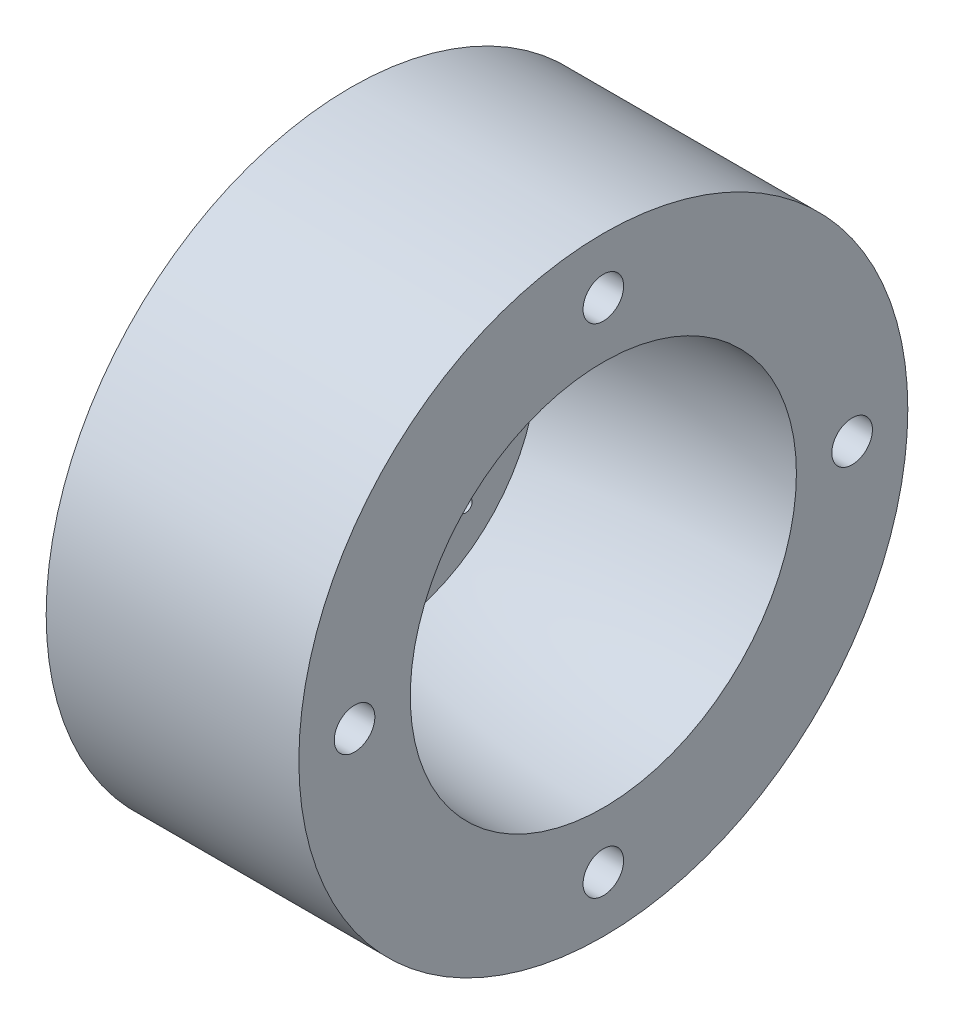
ISO-10303-21;
HEADER;
FILE_DESCRIPTION(('STEP AP214'),'2;1');
FILE_NAME('part.step','',(''),(''),'','','');
FILE_SCHEMA(('AUTOMOTIVE_DESIGN { 1 0 10303 214 1 1 1 1 }'));
ENDSEC;
DATA;
#1=APPLICATION_CONTEXT('core data for automotive mechanical design processes');
#2=APPLICATION_PROTOCOL_DEFINITION('international standard','automotive_design',2000,#1);
#3=PRODUCT_CONTEXT('',#1,'mechanical');
#4=PRODUCT('Part','Part','',(#3));
#5=PRODUCT_RELATED_PRODUCT_CATEGORY('part','',(#4));
#6=PRODUCT_DEFINITION_FORMATION('','',#4);
#7=PRODUCT_DEFINITION_CONTEXT('part definition',#1,'design');
#8=PRODUCT_DEFINITION('design','',#6,#7);
#9=PRODUCT_DEFINITION_SHAPE('','',#8);
#10=(LENGTH_UNIT() NAMED_UNIT(*) SI_UNIT(.MILLI.,.METRE.));
#11=(NAMED_UNIT(*) PLANE_ANGLE_UNIT() SI_UNIT($,.RADIAN.));
#12=(NAMED_UNIT(*) SI_UNIT($,.STERADIAN.) SOLID_ANGLE_UNIT());
#13=UNCERTAINTY_MEASURE_WITH_UNIT(LENGTH_MEASURE(1.E-05),#10,'distance_accuracy_value','');
#14=(GEOMETRIC_REPRESENTATION_CONTEXT(3) GLOBAL_UNCERTAINTY_ASSIGNED_CONTEXT((#13)) GLOBAL_UNIT_ASSIGNED_CONTEXT((#10,
#11,#12)) REPRESENTATION_CONTEXT('',''));
#15=CARTESIAN_POINT('',(0.,0.,0.));
#16=DIRECTION('',(0.,0.,1.));
#17=DIRECTION('',(1.,0.,0.));
#18=AXIS2_PLACEMENT_3D('',#15,#16,#17);
#19=CARTESIAN_POINT('',(0.,0.,0.));
#20=DIRECTION('',(1.,0.,0.));
#21=DIRECTION('',(0.,0.,-1.));
#22=AXIS2_PLACEMENT_3D('',#19,#20,#21);
#23=PLANE('',#22);
#24=CARTESIAN_POINT('',(0.,19.6089948820046,0.));
#25=DIRECTION('',(1.,0.,0.));
#26=DIRECTION('',(0.,0.,-1.));
#27=AXIS2_PLACEMENT_3D('',#24,#25,#26);
#28=CIRCLE('',#27,1.6);
#29=CARTESIAN_POINT('',(0.,19.6089948820046,-1.6));
#30=VERTEX_POINT('',#29);
#31=EDGE_CURVE('E128',#30,#30,#28,.T.);
#32=ORIENTED_EDGE('',*,*,#31,.F.);
#33=EDGE_LOOP('',(#32));
#34=FACE_BOUND('',#33,.T.);
#35=CARTESIAN_POINT('',(0.,0.,19.6089948820046));
#36=DIRECTION('',(1.,0.,0.));
#37=DIRECTION('',(0.,0.,-1.));
#38=AXIS2_PLACEMENT_3D('',#35,#36,#37);
#39=CIRCLE('',#38,1.6);
#40=CARTESIAN_POINT('',(0.,0.,18.0089948820046));
#41=VERTEX_POINT('',#40);
#42=EDGE_CURVE('E132',#41,#41,#39,.T.);
#43=ORIENTED_EDGE('',*,*,#42,.F.);
#44=EDGE_LOOP('',(#43));
#45=FACE_BOUND('',#44,.T.);
#46=CARTESIAN_POINT('',(0.,-19.6089948820046,0.));
#47=DIRECTION('',(1.,0.,0.));
#48=DIRECTION('',(0.,0.,-1.));
#49=AXIS2_PLACEMENT_3D('',#46,#47,#48);
#50=CIRCLE('',#49,1.6);
#51=CARTESIAN_POINT('',(0.,-19.6089948820046,-1.6));
#52=VERTEX_POINT('',#51);
#53=EDGE_CURVE('E85',#52,#52,#50,.T.);
#54=ORIENTED_EDGE('',*,*,#53,.F.);
#55=EDGE_LOOP('',(#54));
#56=FACE_BOUND('',#55,.T.);
#57=CARTESIAN_POINT('',(0.,0.,-19.6089948820046));
#58=DIRECTION('',(1.,0.,0.));
#59=DIRECTION('',(0.,0.,-1.));
#60=AXIS2_PLACEMENT_3D('',#57,#58,#59);
#61=CIRCLE('',#60,1.6);
#62=CARTESIAN_POINT('',(0.,0.,-21.2089948820046));
#63=VERTEX_POINT('',#62);
#64=EDGE_CURVE('E76',#63,#63,#61,.T.);
#65=ORIENTED_EDGE('',*,*,#64,.F.);
#66=EDGE_LOOP('',(#65));
#67=FACE_BOUND('',#66,.T.);
#68=CARTESIAN_POINT('',(0.,0.,0.));
#69=DIRECTION('',(1.,0.,0.));
#70=DIRECTION('',(0.,0.,-1.));
#71=AXIS2_PLACEMENT_3D('',#68,#69,#70);
#72=CIRCLE('',#71,24.);
#73=CARTESIAN_POINT('',(0.,0.,-24.));
#74=VERTEX_POINT('',#73);
#75=EDGE_CURVE('E41',#74,#74,#72,.T.);
#76=ORIENTED_EDGE('',*,*,#75,.T.);
#77=EDGE_LOOP('',(#76));
#78=FACE_BOUND('',#77,.T.);
#79=CARTESIAN_POINT('',(0.,0.,0.));
#80=DIRECTION('',(1.,0.,0.));
#81=DIRECTION('',(0.,0.,-1.));
#82=AXIS2_PLACEMENT_3D('',#79,#80,#81);
#83=CIRCLE('',#82,15.2179897640092);
#84=CARTESIAN_POINT('',(0.,0.,-15.2179897640092));
#85=VERTEX_POINT('',#84);
#86=EDGE_CURVE('E46',#85,#85,#83,.T.);
#87=ORIENTED_EDGE('',*,*,#86,.F.);
#88=EDGE_LOOP('',(#87));
#89=FACE_BOUND('',#88,.T.);
#90=ADVANCED_FACE('F33',(#34,#45,#56,#67,#78,#89),#23,.T.);
#91=CARTESIAN_POINT('',(-19.9164281281048,7.99999999999999,0.));
#92=DIRECTION('',(-1.,0.,0.));
#93=DIRECTION('',(0.,0.,1.));
#94=AXIS2_PLACEMENT_3D('',#91,#92,#93);
#95=PLANE('',#94);
#96=CARTESIAN_POINT('',(-19.9164281281048,10.,0.));
#97=DIRECTION('',(1.,0.,0.));
#98=DIRECTION('',(0.,0.,-1.));
#99=AXIS2_PLACEMENT_3D('',#96,#97,#98);
#100=CIRCLE('',#99,0.5);
#101=CARTESIAN_POINT('',(-19.9164281281048,10.,-0.5));
#102=VERTEX_POINT('',#101);
#103=EDGE_CURVE('E57',#102,#102,#100,.T.);
#104=ORIENTED_EDGE('',*,*,#103,.T.);
#105=EDGE_LOOP('',(#104));
#106=FACE_BOUND('',#105,.T.);
#107=CARTESIAN_POINT('',(-19.9164281281048,7.07106781186549,-7.07106781186546));
#108=DIRECTION('',(1.,0.,0.));
#109=DIRECTION('',(0.,0.,-1.));
#110=AXIS2_PLACEMENT_3D('',#107,#108,#109);
#111=CIRCLE('',#110,0.500000000000001);
#112=CARTESIAN_POINT('',(-19.9164281281048,7.07106781186549,-7.57106781186546));
#113=VERTEX_POINT('',#112);
#114=EDGE_CURVE('E162',#113,#113,#111,.T.);
#115=ORIENTED_EDGE('',*,*,#114,.T.);
#116=EDGE_LOOP('',(#115));
#117=FACE_BOUND('',#116,.T.);
#118=CARTESIAN_POINT('',(-19.9164281281048,-7.07106781186549,7.07106781186546));
#119=DIRECTION('',(1.,0.,0.));
#120=DIRECTION('',(0.,0.,-1.));
#121=AXIS2_PLACEMENT_3D('',#118,#119,#120);
#122=CIRCLE('',#121,0.500000000000001);
#123=CARTESIAN_POINT('',(-19.9164281281048,-7.07106781186549,6.57106781186546));
#124=VERTEX_POINT('',#123);
#125=EDGE_CURVE('E165',#124,#124,#122,.T.);
#126=ORIENTED_EDGE('',*,*,#125,.T.);
#127=EDGE_LOOP('',(#126));
#128=FACE_BOUND('',#127,.T.);
#129=CARTESIAN_POINT('',(-19.9164281281048,-7.07106781186549,-7.07106781186546));
#130=DIRECTION('',(1.,0.,0.));
#131=DIRECTION('',(0.,0.,-1.));
#132=AXIS2_PLACEMENT_3D('',#129,#130,#131);
#133=CIRCLE('',#132,0.5);
#134=CARTESIAN_POINT('',(-19.9164281281048,-7.07106781186549,-7.57106781186546));
#135=VERTEX_POINT('',#134);
#136=EDGE_CURVE('E168',#135,#135,#133,.T.);
#137=ORIENTED_EDGE('',*,*,#136,.T.);
#138=EDGE_LOOP('',(#137));
#139=FACE_BOUND('',#138,.T.);
#140=CARTESIAN_POINT('',(-19.9164281281048,0.,10.));
#141=DIRECTION('',(1.,0.,0.));
#142=DIRECTION('',(0.,0.,-1.));
#143=AXIS2_PLACEMENT_3D('',#140,#141,#142);
#144=CIRCLE('',#143,0.500000000000001);
#145=CARTESIAN_POINT('',(-19.9164281281048,0.,9.5));
#146=VERTEX_POINT('',#145);
#147=EDGE_CURVE('E155',#146,#146,#144,.T.);
#148=ORIENTED_EDGE('',*,*,#147,.T.);
#149=EDGE_LOOP('',(#148));
#150=FACE_BOUND('',#149,.T.);
#151=CARTESIAN_POINT('',(-19.9164281281048,-10.,0.));
#152=DIRECTION('',(1.,0.,0.));
#153=DIRECTION('',(0.,0.,-1.));
#154=AXIS2_PLACEMENT_3D('',#151,#152,#153);
#155=CIRCLE('',#154,0.5);
#156=CARTESIAN_POINT('',(-19.9164281281048,-10.,-0.5));
#157=VERTEX_POINT('',#156);
#158=EDGE_CURVE('E152',#157,#157,#155,.T.);
#159=ORIENTED_EDGE('',*,*,#158,.T.);
#160=EDGE_LOOP('',(#159));
#161=FACE_BOUND('',#160,.T.);
#162=CARTESIAN_POINT('',(-19.9164281281048,0.,-10.));
#163=DIRECTION('',(1.,0.,0.));
#164=DIRECTION('',(0.,0.,-1.));
#165=AXIS2_PLACEMENT_3D('',#162,#163,#164);
#166=CIRCLE('',#165,0.500000000000001);
#167=CARTESIAN_POINT('',(-19.9164281281048,0.,-10.5));
#168=VERTEX_POINT('',#167);
#169=EDGE_CURVE('E156',#168,#168,#166,.T.);
#170=ORIENTED_EDGE('',*,*,#169,.T.);
#171=EDGE_LOOP('',(#170));
#172=FACE_BOUND('',#171,.T.);
#173=CARTESIAN_POINT('',(-19.9164281281048,7.07106781186544,7.07106781186551));
#174=DIRECTION('',(1.,0.,0.));
#175=DIRECTION('',(0.,0.,-1.));
#176=AXIS2_PLACEMENT_3D('',#173,#174,#175);
#177=CIRCLE('',#176,0.5);
#178=CARTESIAN_POINT('',(-19.9164281281048,7.07106781186544,6.57106781186551));
#179=VERTEX_POINT('',#178);
#180=EDGE_CURVE('E159',#179,#179,#177,.T.);
#181=ORIENTED_EDGE('',*,*,#180,.T.);
#182=EDGE_LOOP('',(#181));
#183=FACE_BOUND('',#182,.T.);
#184=CARTESIAN_POINT('',(-19.9164281281048,19.6089948820046,0.));
#185=DIRECTION('',(1.,0.,0.));
#186=DIRECTION('',(0.,0.,-1.));
#187=AXIS2_PLACEMENT_3D('',#184,#185,#186);
#188=CIRCLE('',#187,1.6);
#189=CARTESIAN_POINT('',(-19.9164281281048,19.6089948820046,-1.6));
#190=VERTEX_POINT('',#189);
#191=EDGE_CURVE('E93',#190,#190,#188,.T.);
#192=ORIENTED_EDGE('',*,*,#191,.T.);
#193=EDGE_LOOP('',(#192));
#194=FACE_BOUND('',#193,.T.);
#195=CARTESIAN_POINT('',(-19.9164281281048,0.,19.6089948820046));
#196=DIRECTION('',(1.,0.,0.));
#197=DIRECTION('',(0.,0.,-1.));
#198=AXIS2_PLACEMENT_3D('',#195,#196,#197);
#199=CIRCLE('',#198,1.6);
#200=CARTESIAN_POINT('',(-19.9164281281048,0.,18.0089948820046));
#201=VERTEX_POINT('',#200);
#202=EDGE_CURVE('E146',#201,#201,#199,.T.);
#203=ORIENTED_EDGE('',*,*,#202,.T.);
#204=EDGE_LOOP('',(#203));
#205=FACE_BOUND('',#204,.T.);
#206=CARTESIAN_POINT('',(-19.9164281281048,-19.6089948820046,0.));
#207=DIRECTION('',(1.,0.,0.));
#208=DIRECTION('',(0.,0.,-1.));
#209=AXIS2_PLACEMENT_3D('',#206,#207,#208);
#210=CIRCLE('',#209,1.6);
#211=CARTESIAN_POINT('',(-19.9164281281048,-19.6089948820046,-1.6));
#212=VERTEX_POINT('',#211);
#213=EDGE_CURVE('E141',#212,#212,#210,.T.);
#214=ORIENTED_EDGE('',*,*,#213,.T.);
#215=EDGE_LOOP('',(#214));
#216=FACE_BOUND('',#215,.T.);
#217=CARTESIAN_POINT('',(-19.9164281281048,0.,-19.6089948820046));
#218=DIRECTION('',(1.,0.,0.));
#219=DIRECTION('',(0.,0.,-1.));
#220=AXIS2_PLACEMENT_3D('',#217,#218,#219);
#221=CIRCLE('',#220,1.6);
#222=CARTESIAN_POINT('',(-19.9164281281048,0.,-21.2089948820046));
#223=VERTEX_POINT('',#222);
#224=EDGE_CURVE('E80',#223,#223,#221,.T.);
#225=ORIENTED_EDGE('',*,*,#224,.T.);
#226=EDGE_LOOP('',(#225));
#227=FACE_BOUND('',#226,.T.);
#228=CARTESIAN_POINT('',(-19.9164281281048,0.,0.));
#229=DIRECTION('',(1.,0.,0.));
#230=DIRECTION('',(0.,0.,-1.));
#231=AXIS2_PLACEMENT_3D('',#228,#229,#230);
#232=CIRCLE('',#231,1.25);
#233=CARTESIAN_POINT('',(-19.9164281281048,0.,-1.25));
#234=VERTEX_POINT('',#233);
#235=EDGE_CURVE('E89',#234,#234,#232,.T.);
#236=ORIENTED_EDGE('',*,*,#235,.T.);
#237=EDGE_LOOP('',(#236));
#238=FACE_BOUND('',#237,.T.);
#239=CARTESIAN_POINT('',(-19.9164281281048,0.,0.));
#240=DIRECTION('',(-1.,0.,0.));
#241=DIRECTION('',(0.,0.,1.));
#242=AXIS2_PLACEMENT_3D('',#239,#240,#241);
#243=CIRCLE('',#242,24.);
#244=CARTESIAN_POINT('',(-19.9164281281048,0.,24.));
#245=VERTEX_POINT('',#244);
#246=EDGE_CURVE('E10',#245,#245,#243,.F.);
#247=ORIENTED_EDGE('',*,*,#246,.F.);
#248=EDGE_LOOP('',(#247));
#249=FACE_BOUND('',#248,.T.);
#250=ADVANCED_FACE('F35',(#106,#117,#128,#139,#150,#161,#172,#183,#194,#205,#216,#227,#238,
#249),#95,.T.);
#251=CARTESIAN_POINT('',(-89.7986791220133,0.,0.));
#252=DIRECTION('',(1.,0.,0.));
#253=DIRECTION('',(0.,0.,-1.));
#254=AXIS2_PLACEMENT_3D('',#251,#252,#253);
#255=CYLINDRICAL_SURFACE('',#254,24.);
#256=ORIENTED_EDGE('',*,*,#75,.F.);
#257=EDGE_LOOP('',(#256));
#258=FACE_BOUND('',#257,.T.);
#259=ORIENTED_EDGE('',*,*,#246,.T.);
#260=EDGE_LOOP('',(#259));
#261=FACE_BOUND('',#260,.T.);
#262=ADVANCED_FACE('F108',(#258,#261),#255,.T.);
#263=CARTESIAN_POINT('',(0.,0.,0.));
#264=DIRECTION('',(1.,0.,0.));
#265=DIRECTION('',(0.,0.,-1.));
#266=AXIS2_PLACEMENT_3D('',#263,#264,#265);
#267=DEGENERATE_TOROIDAL_SURFACE('',#266,49.7820102359908,65.,.F.);
#268=ORIENTED_EDGE('',*,*,#86,.T.);
#269=EDGE_LOOP('',(#268));
#270=FACE_BOUND('',#269,.T.);
#271=CARTESIAN_POINT('',(-17.9164281281048,0.,0.));
#272=DIRECTION('',(1.,0.,0.));
#273=DIRECTION('',(0.,0.,-1.));
#274=AXIS2_PLACEMENT_3D('',#271,#272,#273);
#275=CIRCLE('',#274,12.7);
#276=CARTESIAN_POINT('',(-17.9164281281048,0.,-12.7));
#277=VERTEX_POINT('',#276);
#278=EDGE_CURVE('E52',#277,#277,#275,.T.);
#279=ORIENTED_EDGE('',*,*,#278,.F.);
#280=EDGE_LOOP('',(#279));
#281=FACE_BOUND('',#280,.T.);
#282=ADVANCED_FACE('F106',(#270,#281),#267,.T.);
#283=CARTESIAN_POINT('',(-17.9164281281048,7.99999999999999,0.));
#284=DIRECTION('',(-1.,0.,0.));
#285=DIRECTION('',(0.,0.,1.));
#286=AXIS2_PLACEMENT_3D('',#283,#284,#285);
#287=PLANE('',#286);
#288=CARTESIAN_POINT('',(-17.9164281281048,10.,0.));
#289=DIRECTION('',(-1.,0.,0.));
#290=DIRECTION('',(0.,0.,1.));
#291=AXIS2_PLACEMENT_3D('',#288,#289,#290);
#292=CIRCLE('',#291,0.5);
#293=CARTESIAN_POINT('',(-17.9164281281048,10.,0.5));
#294=VERTEX_POINT('',#293);
#295=EDGE_CURVE('E37',#294,#294,#292,.T.);
#296=ORIENTED_EDGE('',*,*,#295,.T.);
#297=EDGE_LOOP('',(#296));
#298=FACE_BOUND('',#297,.T.);
#299=CARTESIAN_POINT('',(-17.9164281281048,7.07106781186549,-7.07106781186546));
#300=DIRECTION('',(-1.,0.,0.));
#301=DIRECTION('',(0.,0.,1.));
#302=AXIS2_PLACEMENT_3D('',#299,#300,#301);
#303=CIRCLE('',#302,0.500000000000001);
#304=CARTESIAN_POINT('',(-17.9164281281048,7.07106781186549,-6.57106781186546));
#305=VERTEX_POINT('',#304);
#306=EDGE_CURVE('E71',#305,#305,#303,.T.);
#307=ORIENTED_EDGE('',*,*,#306,.T.);
#308=EDGE_LOOP('',(#307));
#309=FACE_BOUND('',#308,.T.);
#310=CARTESIAN_POINT('',(-17.9164281281048,-7.07106781186549,7.07106781186546));
#311=DIRECTION('',(-1.,0.,0.));
#312=DIRECTION('',(0.,0.,1.));
#313=AXIS2_PLACEMENT_3D('',#310,#311,#312);
#314=CIRCLE('',#313,0.500000000000001);
#315=CARTESIAN_POINT('',(-17.9164281281048,-7.07106781186549,7.57106781186546));
#316=VERTEX_POINT('',#315);
#317=EDGE_CURVE('E69',#316,#316,#314,.T.);
#318=ORIENTED_EDGE('',*,*,#317,.T.);
#319=EDGE_LOOP('',(#318));
#320=FACE_BOUND('',#319,.T.);
#321=CARTESIAN_POINT('',(-17.9164281281048,-7.07106781186549,-7.07106781186546));
#322=DIRECTION('',(-1.,0.,0.));
#323=DIRECTION('',(0.,0.,1.));
#324=AXIS2_PLACEMENT_3D('',#321,#322,#323);
#325=CIRCLE('',#324,0.5);
#326=CARTESIAN_POINT('',(-17.9164281281048,-7.07106781186549,-6.57106781186547));
#327=VERTEX_POINT('',#326);
#328=EDGE_CURVE('E66',#327,#327,#325,.T.);
#329=ORIENTED_EDGE('',*,*,#328,.T.);
#330=EDGE_LOOP('',(#329));
#331=FACE_BOUND('',#330,.T.);
#332=CARTESIAN_POINT('',(-17.9164281281048,0.,10.));
#333=DIRECTION('',(-1.,0.,0.));
#334=DIRECTION('',(0.,0.,1.));
#335=AXIS2_PLACEMENT_3D('',#332,#333,#334);
#336=CIRCLE('',#335,0.500000000000001);
#337=CARTESIAN_POINT('',(-17.9164281281048,0.,10.5));
#338=VERTEX_POINT('',#337);
#339=EDGE_CURVE('E63',#338,#338,#336,.T.);
#340=ORIENTED_EDGE('',*,*,#339,.T.);
#341=EDGE_LOOP('',(#340));
#342=FACE_BOUND('',#341,.T.);
#343=CARTESIAN_POINT('',(-17.9164281281048,-10.,0.));
#344=DIRECTION('',(-1.,0.,0.));
#345=DIRECTION('',(0.,0.,1.));
#346=AXIS2_PLACEMENT_3D('',#343,#344,#345);
#347=CIRCLE('',#346,0.5);
#348=CARTESIAN_POINT('',(-17.9164281281048,-10.,0.5));
#349=VERTEX_POINT('',#348);
#350=EDGE_CURVE('E60',#349,#349,#347,.T.);
#351=ORIENTED_EDGE('',*,*,#350,.T.);
#352=EDGE_LOOP('',(#351));
#353=FACE_BOUND('',#352,.T.);
#354=CARTESIAN_POINT('',(-17.9164281281048,0.,-10.));
#355=DIRECTION('',(-1.,0.,0.));
#356=DIRECTION('',(0.,0.,1.));
#357=AXIS2_PLACEMENT_3D('',#354,#355,#356);
#358=CIRCLE('',#357,0.500000000000001);
#359=CARTESIAN_POINT('',(-17.9164281281048,0.,-9.5));
#360=VERTEX_POINT('',#359);
#361=EDGE_CURVE('E56',#360,#360,#358,.T.);
#362=ORIENTED_EDGE('',*,*,#361,.T.);
#363=EDGE_LOOP('',(#362));
#364=FACE_BOUND('',#363,.T.);
#365=CARTESIAN_POINT('',(-17.9164281281048,7.07106781186544,7.07106781186551));
#366=DIRECTION('',(-1.,0.,0.));
#367=DIRECTION('',(0.,0.,1.));
#368=AXIS2_PLACEMENT_3D('',#365,#366,#367);
#369=CIRCLE('',#368,0.5);
#370=CARTESIAN_POINT('',(-17.9164281281048,7.07106781186544,7.57106781186551));
#371=VERTEX_POINT('',#370);
#372=EDGE_CURVE('E53',#371,#371,#369,.T.);
#373=ORIENTED_EDGE('',*,*,#372,.T.);
#374=EDGE_LOOP('',(#373));
#375=FACE_BOUND('',#374,.T.);
#376=CARTESIAN_POINT('',(-17.9164281281048,0.,0.));
#377=DIRECTION('',(1.,0.,0.));
#378=DIRECTION('',(0.,0.,-1.));
#379=AXIS2_PLACEMENT_3D('',#376,#377,#378);
#380=CIRCLE('',#379,7.99999999999999);
#381=CARTESIAN_POINT('',(-17.9164281281048,0.,-7.99999999999999));
#382=VERTEX_POINT('',#381);
#383=EDGE_CURVE('E99',#382,#382,#380,.T.);
#384=ORIENTED_EDGE('',*,*,#383,.F.);
#385=EDGE_LOOP('',(#384));
#386=FACE_BOUND('',#385,.T.);
#387=ORIENTED_EDGE('',*,*,#278,.T.);
#388=EDGE_LOOP('',(#387));
#389=FACE_BOUND('',#388,.T.);
#390=ADVANCED_FACE('F104',(#298,#309,#320,#331,#342,#353,#364,#375,#386,#389),#287,.F.);
#391=CARTESIAN_POINT('',(17.9164281281048,0.,0.));
#392=DIRECTION('',(1.,0.,0.));
#393=DIRECTION('',(0.,0.,-1.));
#394=AXIS2_PLACEMENT_3D('',#391,#392,#393);
#395=CYLINDRICAL_SURFACE('',#394,7.99999999999999);
#396=CARTESIAN_POINT('',(-17.4164281281047,0.,0.));
#397=DIRECTION('',(-1.,0.,0.));
#398=DIRECTION('',(0.,0.,1.));
#399=AXIS2_PLACEMENT_3D('',#396,#397,#398);
#400=CIRCLE('',#399,7.99999999999999);
#401=CARTESIAN_POINT('',(-17.4164281281047,0.,7.99999999999999));
#402=VERTEX_POINT('',#401);
#403=EDGE_CURVE('E96',#402,#402,#400,.T.);
#404=ORIENTED_EDGE('',*,*,#403,.T.);
#405=EDGE_LOOP('',(#404));
#406=FACE_BOUND('',#405,.T.);
#407=ORIENTED_EDGE('',*,*,#383,.T.);
#408=EDGE_LOOP('',(#407));
#409=FACE_BOUND('',#408,.T.);
#410=ADVANCED_FACE('F115',(#406,#409),#395,.T.);
#411=CARTESIAN_POINT('',(-17.4164281281047,1.25,0.));
#412=DIRECTION('',(-1.,0.,0.));
#413=DIRECTION('',(0.,0.,1.));
#414=AXIS2_PLACEMENT_3D('',#411,#412,#413);
#415=PLANE('',#414);
#416=CARTESIAN_POINT('',(-17.4164281281047,0.,0.));
#417=DIRECTION('',(-1.,0.,0.));
#418=DIRECTION('',(0.,0.,1.));
#419=AXIS2_PLACEMENT_3D('',#416,#417,#418);
#420=CIRCLE('',#419,1.25);
#421=CARTESIAN_POINT('',(-17.4164281281047,0.,1.25));
#422=VERTEX_POINT('',#421);
#423=EDGE_CURVE('E92',#422,#422,#420,.T.);
#424=ORIENTED_EDGE('',*,*,#423,.T.);
#425=EDGE_LOOP('',(#424));
#426=FACE_BOUND('',#425,.T.);
#427=ORIENTED_EDGE('',*,*,#403,.F.);
#428=EDGE_LOOP('',(#427));
#429=FACE_BOUND('',#428,.T.);
#430=ADVANCED_FACE('F231',(#426,#429),#415,.F.);
#431=CARTESIAN_POINT('',(-19.9164281281048,0.,0.));
#432=DIRECTION('',(1.,0.,0.));
#433=DIRECTION('',(0.,0.,-1.));
#434=AXIS2_PLACEMENT_3D('',#431,#432,#433);
#435=CYLINDRICAL_SURFACE('',#434,1.25);
#436=ORIENTED_EDGE('',*,*,#235,.F.);
#437=EDGE_LOOP('',(#436));
#438=FACE_BOUND('',#437,.T.);
#439=ORIENTED_EDGE('',*,*,#423,.F.);
#440=EDGE_LOOP('',(#439));
#441=FACE_BOUND('',#440,.T.);
#442=ADVANCED_FACE('F227',(#438,#441),#435,.F.);
#443=CARTESIAN_POINT('',(-19.9164281281048,0.,-19.6089948820046));
#444=DIRECTION('',(1.,0.,0.));
#445=DIRECTION('',(0.,0.,-1.));
#446=AXIS2_PLACEMENT_3D('',#443,#444,#445);
#447=CYLINDRICAL_SURFACE('',#446,1.6);
#448=ORIENTED_EDGE('',*,*,#224,.F.);
#449=EDGE_LOOP('',(#448));
#450=FACE_BOUND('',#449,.T.);
#451=ORIENTED_EDGE('',*,*,#64,.T.);
#452=EDGE_LOOP('',(#451));
#453=FACE_BOUND('',#452,.T.);
#454=ADVANCED_FACE('F223',(#450,#453),#447,.F.);
#455=CARTESIAN_POINT('',(-19.9164281281048,-19.6089948820046,0.));
#456=DIRECTION('',(1.,0.,0.));
#457=DIRECTION('',(0.,0.,-1.));
#458=AXIS2_PLACEMENT_3D('',#455,#456,#457);
#459=CYLINDRICAL_SURFACE('',#458,1.6);
#460=ORIENTED_EDGE('',*,*,#213,.F.);
#461=EDGE_LOOP('',(#460));
#462=FACE_BOUND('',#461,.T.);
#463=ORIENTED_EDGE('',*,*,#53,.T.);
#464=EDGE_LOOP('',(#463));
#465=FACE_BOUND('',#464,.T.);
#466=ADVANCED_FACE('F219',(#462,#465),#459,.F.);
#467=CARTESIAN_POINT('',(-19.9164281281048,0.,19.6089948820046));
#468=DIRECTION('',(1.,0.,0.));
#469=DIRECTION('',(0.,0.,-1.));
#470=AXIS2_PLACEMENT_3D('',#467,#468,#469);
#471=CYLINDRICAL_SURFACE('',#470,1.6);
#472=ORIENTED_EDGE('',*,*,#202,.F.);
#473=EDGE_LOOP('',(#472));
#474=FACE_BOUND('',#473,.T.);
#475=ORIENTED_EDGE('',*,*,#42,.T.);
#476=EDGE_LOOP('',(#475));
#477=FACE_BOUND('',#476,.T.);
#478=ADVANCED_FACE('F215',(#474,#477),#471,.F.);
#479=CARTESIAN_POINT('',(-19.9164281281048,19.6089948820046,0.));
#480=DIRECTION('',(1.,0.,0.));
#481=DIRECTION('',(0.,0.,-1.));
#482=AXIS2_PLACEMENT_3D('',#479,#480,#481);
#483=CYLINDRICAL_SURFACE('',#482,1.6);
#484=ORIENTED_EDGE('',*,*,#191,.F.);
#485=EDGE_LOOP('',(#484));
#486=FACE_BOUND('',#485,.T.);
#487=ORIENTED_EDGE('',*,*,#31,.T.);
#488=EDGE_LOOP('',(#487));
#489=FACE_BOUND('',#488,.T.);
#490=ADVANCED_FACE('F205',(#486,#489),#483,.F.);
#491=CARTESIAN_POINT('',(-19.9164281281048,7.07106781186544,7.07106781186551));
#492=DIRECTION('',(1.,0.,0.));
#493=DIRECTION('',(0.,0.,-1.));
#494=AXIS2_PLACEMENT_3D('',#491,#492,#493);
#495=CYLINDRICAL_SURFACE('',#494,0.5);
#496=ORIENTED_EDGE('',*,*,#180,.F.);
#497=EDGE_LOOP('',(#496));
#498=FACE_BOUND('',#497,.T.);
#499=ORIENTED_EDGE('',*,*,#372,.F.);
#500=EDGE_LOOP('',(#499));
#501=FACE_BOUND('',#500,.T.);
#502=ADVANCED_FACE('F201',(#498,#501),#495,.F.);
#503=CARTESIAN_POINT('',(-19.9164281281048,0.,-10.));
#504=DIRECTION('',(1.,0.,0.));
#505=DIRECTION('',(0.,0.,-1.));
#506=AXIS2_PLACEMENT_3D('',#503,#504,#505);
#507=CYLINDRICAL_SURFACE('',#506,0.500000000000001);
#508=ORIENTED_EDGE('',*,*,#169,.F.);
#509=EDGE_LOOP('',(#508));
#510=FACE_BOUND('',#509,.T.);
#511=ORIENTED_EDGE('',*,*,#361,.F.);
#512=EDGE_LOOP('',(#511));
#513=FACE_BOUND('',#512,.T.);
#514=ADVANCED_FACE('F197',(#510,#513),#507,.F.);
#515=CARTESIAN_POINT('',(-19.9164281281048,-10.,0.));
#516=DIRECTION('',(1.,0.,0.));
#517=DIRECTION('',(0.,0.,-1.));
#518=AXIS2_PLACEMENT_3D('',#515,#516,#517);
#519=CYLINDRICAL_SURFACE('',#518,0.5);
#520=ORIENTED_EDGE('',*,*,#158,.F.);
#521=EDGE_LOOP('',(#520));
#522=FACE_BOUND('',#521,.T.);
#523=ORIENTED_EDGE('',*,*,#350,.F.);
#524=EDGE_LOOP('',(#523));
#525=FACE_BOUND('',#524,.T.);
#526=ADVANCED_FACE('F200',(#522,#525),#519,.F.);
#527=CARTESIAN_POINT('',(-19.9164281281048,0.,10.));
#528=DIRECTION('',(1.,0.,0.));
#529=DIRECTION('',(0.,0.,-1.));
#530=AXIS2_PLACEMENT_3D('',#527,#528,#529);
#531=CYLINDRICAL_SURFACE('',#530,0.500000000000001);
#532=ORIENTED_EDGE('',*,*,#147,.F.);
#533=EDGE_LOOP('',(#532));
#534=FACE_BOUND('',#533,.T.);
#535=ORIENTED_EDGE('',*,*,#339,.F.);
#536=EDGE_LOOP('',(#535));
#537=FACE_BOUND('',#536,.T.);
#538=ADVANCED_FACE('F191',(#534,#537),#531,.F.);
#539=CARTESIAN_POINT('',(-19.9164281281048,-7.07106781186549,-7.07106781186546));
#540=DIRECTION('',(1.,0.,0.));
#541=DIRECTION('',(0.,0.,-1.));
#542=AXIS2_PLACEMENT_3D('',#539,#540,#541);
#543=CYLINDRICAL_SURFACE('',#542,0.5);
#544=ORIENTED_EDGE('',*,*,#136,.F.);
#545=EDGE_LOOP('',(#544));
#546=FACE_BOUND('',#545,.T.);
#547=ORIENTED_EDGE('',*,*,#328,.F.);
#548=EDGE_LOOP('',(#547));
#549=FACE_BOUND('',#548,.T.);
#550=ADVANCED_FACE('F189',(#546,#549),#543,.F.);
#551=CARTESIAN_POINT('',(-19.9164281281048,-7.07106781186549,7.07106781186546));
#552=DIRECTION('',(1.,0.,0.));
#553=DIRECTION('',(0.,0.,-1.));
#554=AXIS2_PLACEMENT_3D('',#551,#552,#553);
#555=CYLINDRICAL_SURFACE('',#554,0.500000000000001);
#556=ORIENTED_EDGE('',*,*,#125,.F.);
#557=EDGE_LOOP('',(#556));
#558=FACE_BOUND('',#557,.T.);
#559=ORIENTED_EDGE('',*,*,#317,.F.);
#560=EDGE_LOOP('',(#559));
#561=FACE_BOUND('',#560,.T.);
#562=ADVANCED_FACE('F185',(#558,#561),#555,.F.);
#563=CARTESIAN_POINT('',(-19.9164281281048,7.07106781186549,-7.07106781186546));
#564=DIRECTION('',(1.,0.,0.));
#565=DIRECTION('',(0.,0.,-1.));
#566=AXIS2_PLACEMENT_3D('',#563,#564,#565);
#567=CYLINDRICAL_SURFACE('',#566,0.500000000000001);
#568=ORIENTED_EDGE('',*,*,#114,.F.);
#569=EDGE_LOOP('',(#568));
#570=FACE_BOUND('',#569,.T.);
#571=ORIENTED_EDGE('',*,*,#306,.F.);
#572=EDGE_LOOP('',(#571));
#573=FACE_BOUND('',#572,.T.);
#574=ADVANCED_FACE('F180',(#570,#573),#567,.F.);
#575=CARTESIAN_POINT('',(-19.9164281281048,10.,0.));
#576=DIRECTION('',(1.,0.,0.));
#577=DIRECTION('',(0.,0.,-1.));
#578=AXIS2_PLACEMENT_3D('',#575,#576,#577);
#579=CYLINDRICAL_SURFACE('',#578,0.5);
#580=ORIENTED_EDGE('',*,*,#103,.F.);
#581=EDGE_LOOP('',(#580));
#582=FACE_BOUND('',#581,.T.);
#583=ORIENTED_EDGE('',*,*,#295,.F.);
#584=EDGE_LOOP('',(#583));
#585=FACE_BOUND('',#584,.T.);
#586=ADVANCED_FACE('F177',(#582,#585),#579,.F.);
#587=CLOSED_SHELL('',(#90,#250,#262,#282,#390,#410,#430,#442,#454,#466,#478,#490,#502,#514,#526,
#538,#550,#562,#574,#586));
#588=MANIFOLD_SOLID_BREP('B2',#587);
#589=ADVANCED_BREP_SHAPE_REPRESENTATION('',(#18,#588),#14);
#590=SHAPE_DEFINITION_REPRESENTATION(#9,#589);
ENDSEC;
END-ISO-10303-21;
